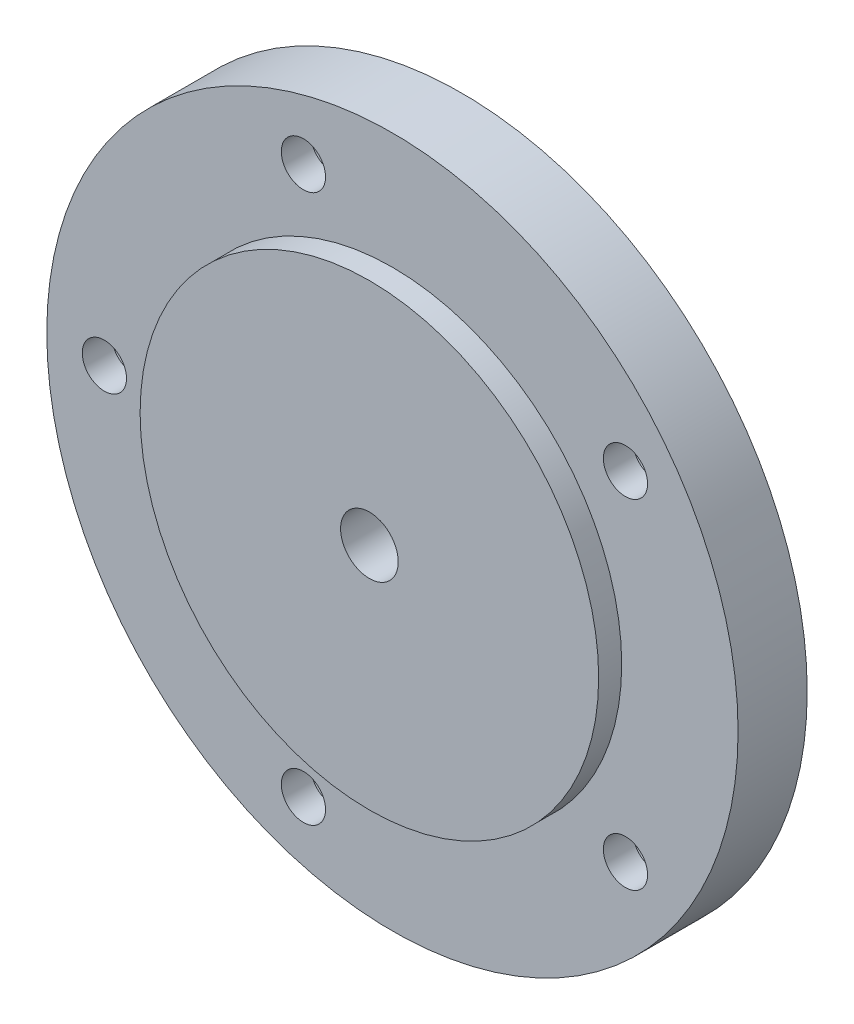
ISO-10303-21;
HEADER;
FILE_DESCRIPTION(('STEP AP214'),'2;1');
FILE_NAME('part.step','',(''),(''),'','','');
FILE_SCHEMA(('AUTOMOTIVE_DESIGN { 1 0 10303 214 1 1 1 1 }'));
ENDSEC;
DATA;
#1=APPLICATION_CONTEXT('core data for automotive mechanical design processes');
#2=APPLICATION_PROTOCOL_DEFINITION('international standard','automotive_design',2000,#1);
#3=PRODUCT_CONTEXT('',#1,'mechanical');
#4=PRODUCT('Part','Part','',(#3));
#5=PRODUCT_RELATED_PRODUCT_CATEGORY('part','',(#4));
#6=PRODUCT_DEFINITION_FORMATION('','',#4);
#7=PRODUCT_DEFINITION_CONTEXT('part definition',#1,'design');
#8=PRODUCT_DEFINITION('design','',#6,#7);
#9=PRODUCT_DEFINITION_SHAPE('','',#8);
#10=(LENGTH_UNIT() NAMED_UNIT(*) SI_UNIT(.MILLI.,.METRE.));
#11=(NAMED_UNIT(*) PLANE_ANGLE_UNIT() SI_UNIT($,.RADIAN.));
#12=(NAMED_UNIT(*) SI_UNIT($,.STERADIAN.) SOLID_ANGLE_UNIT());
#13=UNCERTAINTY_MEASURE_WITH_UNIT(LENGTH_MEASURE(1.E-05),#10,'distance_accuracy_value','');
#14=(GEOMETRIC_REPRESENTATION_CONTEXT(3) GLOBAL_UNCERTAINTY_ASSIGNED_CONTEXT((#13)) GLOBAL_UNIT_ASSIGNED_CONTEXT((#10,
#11,#12)) REPRESENTATION_CONTEXT('',''));
#15=CARTESIAN_POINT('',(0.,0.,0.));
#16=DIRECTION('',(0.,0.,1.));
#17=DIRECTION('',(1.,0.,0.));
#18=AXIS2_PLACEMENT_3D('',#15,#16,#17);
#19=CARTESIAN_POINT('',(0.,0.,3.81));
#20=DIRECTION('',(0.,0.,-1.));
#21=DIRECTION('',(-1.,0.,0.));
#22=AXIS2_PLACEMENT_3D('',#19,#20,#21);
#23=CYLINDRICAL_SURFACE('',#22,19.05);
#24=CARTESIAN_POINT('',(0.,0.,3.81));
#25=DIRECTION('',(0.,0.,1.));
#26=DIRECTION('',(1.,0.,0.));
#27=AXIS2_PLACEMENT_3D('',#24,#25,#26);
#28=CIRCLE('',#27,19.05);
#29=CARTESIAN_POINT('',(19.05,0.,3.81));
#30=VERTEX_POINT('',#29);
#31=EDGE_CURVE('E10',#30,#30,#28,.T.);
#32=ORIENTED_EDGE('',*,*,#31,.F.);
#33=EDGE_LOOP('',(#32));
#34=FACE_BOUND('',#33,.T.);
#35=CARTESIAN_POINT('',(0.,0.,0.));
#36=DIRECTION('',(0.,0.,1.));
#37=DIRECTION('',(1.,0.,0.));
#38=AXIS2_PLACEMENT_3D('',#35,#36,#37);
#39=CIRCLE('',#38,19.05);
#40=CARTESIAN_POINT('',(19.05,0.,0.));
#41=VERTEX_POINT('',#40);
#42=EDGE_CURVE('E38',#41,#41,#39,.T.);
#43=ORIENTED_EDGE('',*,*,#42,.T.);
#44=EDGE_LOOP('',(#43));
#45=FACE_BOUND('',#44,.T.);
#46=ADVANCED_FACE('F31',(#34,#45),#23,.T.);
#47=CARTESIAN_POINT('',(0.,0.,3.81));
#48=DIRECTION('',(0.,0.,1.));
#49=DIRECTION('',(1.,0.,0.));
#50=AXIS2_PLACEMENT_3D('',#47,#48,#49);
#51=PLANE('',#50);
#52=CARTESIAN_POINT('',(-4.90564478570246,-15.0980221961855,3.81));
#53=DIRECTION('',(0.,0.,1.));
#54=DIRECTION('',(1.,0.,0.));
#55=AXIS2_PLACEMENT_3D('',#52,#53,#54);
#56=CIRCLE('',#55,1.2192);
#57=CARTESIAN_POINT('',(-3.68644478570246,-15.0980221961855,3.81));
#58=VERTEX_POINT('',#57);
#59=EDGE_CURVE('E34',#58,#58,#56,.T.);
#60=ORIENTED_EDGE('',*,*,#59,.F.);
#61=EDGE_LOOP('',(#60));
#62=FACE_BOUND('',#61,.T.);
#63=CARTESIAN_POINT('',(12.8431447857022,-9.33109088014312,3.81));
#64=DIRECTION('',(0.,0.,1.));
#65=DIRECTION('',(1.,0.,0.));
#66=AXIS2_PLACEMENT_3D('',#63,#64,#65);
#67=CIRCLE('',#66,1.2192);
#68=CARTESIAN_POINT('',(14.0623447857022,-9.33109088014312,3.81));
#69=VERTEX_POINT('',#68);
#70=EDGE_CURVE('E62',#69,#69,#67,.T.);
#71=ORIENTED_EDGE('',*,*,#70,.F.);
#72=EDGE_LOOP('',(#71));
#73=FACE_BOUND('',#72,.T.);
#74=CARTESIAN_POINT('',(12.8431447857023,9.33109088014294,3.81));
#75=DIRECTION('',(0.,0.,1.));
#76=DIRECTION('',(1.,0.,0.));
#77=AXIS2_PLACEMENT_3D('',#74,#75,#76);
#78=CIRCLE('',#77,1.2192);
#79=CARTESIAN_POINT('',(14.0623447857023,9.33109088014294,3.81));
#80=VERTEX_POINT('',#79);
#81=EDGE_CURVE('E58',#80,#80,#78,.T.);
#82=ORIENTED_EDGE('',*,*,#81,.F.);
#83=EDGE_LOOP('',(#82));
#84=FACE_BOUND('',#83,.T.);
#85=CARTESIAN_POINT('',(-4.90564478570225,15.0980221961856,3.81));
#86=DIRECTION('',(0.,0.,1.));
#87=DIRECTION('',(1.,0.,0.));
#88=AXIS2_PLACEMENT_3D('',#85,#86,#87);
#89=CIRCLE('',#88,1.2192);
#90=CARTESIAN_POINT('',(-3.68644478570225,15.0980221961856,3.81));
#91=VERTEX_POINT('',#90);
#92=EDGE_CURVE('E53',#91,#91,#89,.T.);
#93=ORIENTED_EDGE('',*,*,#92,.F.);
#94=EDGE_LOOP('',(#93));
#95=FACE_BOUND('',#94,.T.);
#96=CARTESIAN_POINT('',(-15.875,0.,3.81));
#97=DIRECTION('',(0.,0.,1.));
#98=DIRECTION('',(1.,0.,0.));
#99=AXIS2_PLACEMENT_3D('',#96,#97,#98);
#100=CIRCLE('',#99,1.2192);
#101=CARTESIAN_POINT('',(-14.6558,0.,3.81));
#102=VERTEX_POINT('',#101);
#103=EDGE_CURVE('E49',#102,#102,#100,.T.);
#104=ORIENTED_EDGE('',*,*,#103,.F.);
#105=EDGE_LOOP('',(#104));
#106=FACE_BOUND('',#105,.T.);
#107=CARTESIAN_POINT('',(0.,0.,3.81));
#108=DIRECTION('',(0.,0.,1.));
#109=DIRECTION('',(1.,0.,0.));
#110=AXIS2_PLACEMENT_3D('',#107,#108,#109);
#111=CIRCLE('',#110,12.6365);
#112=CARTESIAN_POINT('',(12.6365,0.,3.81));
#113=VERTEX_POINT('',#112);
#114=EDGE_CURVE('E46',#113,#113,#111,.T.);
#115=ORIENTED_EDGE('',*,*,#114,.F.);
#116=EDGE_LOOP('',(#115));
#117=FACE_BOUND('',#116,.T.);
#118=ORIENTED_EDGE('',*,*,#31,.T.);
#119=EDGE_LOOP('',(#118));
#120=FACE_BOUND('',#119,.T.);
#121=ADVANCED_FACE('F106',(#62,#73,#84,#95,#106,#117,#120),#51,.T.);
#122=CARTESIAN_POINT('',(0.,0.,0.));
#123=DIRECTION('',(0.,0.,1.));
#124=DIRECTION('',(1.,0.,0.));
#125=AXIS2_PLACEMENT_3D('',#122,#123,#124);
#126=PLANE('',#125);
#127=CARTESIAN_POINT('',(0.,0.,0.));
#128=DIRECTION('',(0.,0.,-1.));
#129=DIRECTION('',(-1.,0.,0.));
#130=AXIS2_PLACEMENT_3D('',#127,#128,#129);
#131=CIRCLE('',#130,1.58749999999999);
#132=CARTESIAN_POINT('',(-1.58749999999999,0.,0.));
#133=VERTEX_POINT('',#132);
#134=EDGE_CURVE('E197',#133,#133,#131,.T.);
#135=ORIENTED_EDGE('',*,*,#134,.F.);
#136=EDGE_LOOP('',(#135));
#137=FACE_BOUND('',#136,.T.);
#138=CARTESIAN_POINT('',(-4.90564478570246,-15.0980221961855,0.));
#139=DIRECTION('',(0.,0.,-1.));
#140=DIRECTION('',(-1.,0.,0.));
#141=AXIS2_PLACEMENT_3D('',#138,#139,#140);
#142=CIRCLE('',#141,2.38124999999999);
#143=CARTESIAN_POINT('',(-7.28689478570246,-15.0980221961855,0.));
#144=VERTEX_POINT('',#143);
#145=EDGE_CURVE('E199',#144,#144,#142,.T.);
#146=ORIENTED_EDGE('',*,*,#145,.F.);
#147=EDGE_LOOP('',(#146));
#148=FACE_BOUND('',#147,.T.);
#149=CARTESIAN_POINT('',(12.8431447857022,-9.33109088014312,0.));
#150=DIRECTION('',(0.,0.,-1.));
#151=DIRECTION('',(-1.,0.,0.));
#152=AXIS2_PLACEMENT_3D('',#149,#150,#151);
#153=CIRCLE('',#152,2.38124999999999);
#154=CARTESIAN_POINT('',(10.4618947857022,-9.33109088014312,0.));
#155=VERTEX_POINT('',#154);
#156=EDGE_CURVE('E77',#155,#155,#153,.T.);
#157=ORIENTED_EDGE('',*,*,#156,.F.);
#158=EDGE_LOOP('',(#157));
#159=FACE_BOUND('',#158,.T.);
#160=CARTESIAN_POINT('',(12.8431447857023,9.33109088014294,0.));
#161=DIRECTION('',(0.,0.,-1.));
#162=DIRECTION('',(-1.,0.,0.));
#163=AXIS2_PLACEMENT_3D('',#160,#161,#162);
#164=CIRCLE('',#163,2.38124999999999);
#165=CARTESIAN_POINT('',(10.4618947857024,9.33109088014294,0.));
#166=VERTEX_POINT('',#165);
#167=EDGE_CURVE('E64',#166,#166,#164,.T.);
#168=ORIENTED_EDGE('',*,*,#167,.F.);
#169=EDGE_LOOP('',(#168));
#170=FACE_BOUND('',#169,.T.);
#171=CARTESIAN_POINT('',(-4.90564478570225,15.0980221961856,0.));
#172=DIRECTION('',(0.,0.,-1.));
#173=DIRECTION('',(-1.,0.,0.));
#174=AXIS2_PLACEMENT_3D('',#171,#172,#173);
#175=CIRCLE('',#174,2.38124999999999);
#176=CARTESIAN_POINT('',(-7.28689478570224,15.0980221961856,0.));
#177=VERTEX_POINT('',#176);
#178=EDGE_CURVE('E60',#177,#177,#175,.T.);
#179=ORIENTED_EDGE('',*,*,#178,.F.);
#180=EDGE_LOOP('',(#179));
#181=FACE_BOUND('',#180,.T.);
#182=CARTESIAN_POINT('',(-15.875,0.,0.));
#183=DIRECTION('',(0.,0.,-1.));
#184=DIRECTION('',(-1.,0.,0.));
#185=AXIS2_PLACEMENT_3D('',#182,#183,#184);
#186=CIRCLE('',#185,2.38124999999999);
#187=CARTESIAN_POINT('',(-18.25625,0.,0.));
#188=VERTEX_POINT('',#187);
#189=EDGE_CURVE('E56',#188,#188,#186,.T.);
#190=ORIENTED_EDGE('',*,*,#189,.F.);
#191=EDGE_LOOP('',(#190));
#192=FACE_BOUND('',#191,.T.);
#193=ORIENTED_EDGE('',*,*,#42,.F.);
#194=EDGE_LOOP('',(#193));
#195=FACE_BOUND('',#194,.T.);
#196=ADVANCED_FACE('F108',(#137,#148,#159,#170,#181,#192,#195),#126,.F.);
#197=CARTESIAN_POINT('',(0.,0.,5.08));
#198=DIRECTION('',(0.,0.,-1.));
#199=DIRECTION('',(-1.,0.,0.));
#200=AXIS2_PLACEMENT_3D('',#197,#198,#199);
#201=CYLINDRICAL_SURFACE('',#200,12.6365);
#202=CARTESIAN_POINT('',(0.,0.,5.08));
#203=DIRECTION('',(0.,0.,1.));
#204=DIRECTION('',(1.,0.,0.));
#205=AXIS2_PLACEMENT_3D('',#202,#203,#204);
#206=CIRCLE('',#205,12.6365);
#207=CARTESIAN_POINT('',(12.6365,0.,5.08));
#208=VERTEX_POINT('',#207);
#209=EDGE_CURVE('E43',#208,#208,#206,.T.);
#210=ORIENTED_EDGE('',*,*,#209,.F.);
#211=EDGE_LOOP('',(#210));
#212=FACE_BOUND('',#211,.T.);
#213=ORIENTED_EDGE('',*,*,#114,.T.);
#214=EDGE_LOOP('',(#213));
#215=FACE_BOUND('',#214,.T.);
#216=ADVANCED_FACE('F104',(#212,#215),#201,.T.);
#217=CARTESIAN_POINT('',(0.,0.,5.08));
#218=DIRECTION('',(0.,0.,1.));
#219=DIRECTION('',(1.,0.,0.));
#220=AXIS2_PLACEMENT_3D('',#217,#218,#219);
#221=PLANE('',#220);
#222=CARTESIAN_POINT('',(0.,0.,5.08));
#223=DIRECTION('',(0.,0.,-1.));
#224=DIRECTION('',(-1.,0.,0.));
#225=AXIS2_PLACEMENT_3D('',#222,#223,#224);
#226=CIRCLE('',#225,1.5875);
#227=CARTESIAN_POINT('',(-1.5875,0.,5.08));
#228=VERTEX_POINT('',#227);
#229=EDGE_CURVE('E194',#228,#228,#226,.T.);
#230=ORIENTED_EDGE('',*,*,#229,.T.);
#231=EDGE_LOOP('',(#230));
#232=FACE_BOUND('',#231,.T.);
#233=ORIENTED_EDGE('',*,*,#209,.T.);
#234=EDGE_LOOP('',(#233));
#235=FACE_BOUND('',#234,.T.);
#236=ADVANCED_FACE('F122',(#232,#235),#221,.T.);
#237=CARTESIAN_POINT('',(-15.875,0.,0.));
#238=DIRECTION('',(0.,0.,-1.));
#239=DIRECTION('',(-1.,0.,0.));
#240=AXIS2_PLACEMENT_3D('',#237,#238,#239);
#241=CYLINDRICAL_SURFACE('',#240,1.2192);
#242=ORIENTED_EDGE('',*,*,#103,.T.);
#243=EDGE_LOOP('',(#242));
#244=FACE_BOUND('',#243,.T.);
#245=CARTESIAN_POINT('',(-15.875,0.,2.1844));
#246=DIRECTION('',(0.,0.,-1.));
#247=DIRECTION('',(-1.,0.,0.));
#248=AXIS2_PLACEMENT_3D('',#245,#246,#247);
#249=CIRCLE('',#248,1.2192);
#250=CARTESIAN_POINT('',(-17.0942,0.,2.1844));
#251=VERTEX_POINT('',#250);
#252=EDGE_CURVE('E52',#251,#251,#249,.T.);
#253=ORIENTED_EDGE('',*,*,#252,.T.);
#254=EDGE_LOOP('',(#253));
#255=FACE_BOUND('',#254,.T.);
#256=ADVANCED_FACE('F126',(#244,#255),#241,.F.);
#257=CARTESIAN_POINT('',(-14.6558,0.,2.1844));
#258=DIRECTION('',(0.,0.,1.));
#259=DIRECTION('',(1.,0.,0.));
#260=AXIS2_PLACEMENT_3D('',#257,#258,#259);
#261=PLANE('',#260);
#262=ORIENTED_EDGE('',*,*,#252,.F.);
#263=EDGE_LOOP('',(#262));
#264=FACE_BOUND('',#263,.T.);
#265=CARTESIAN_POINT('',(-15.875,0.,2.1844));
#266=DIRECTION('',(0.,0.,-1.));
#267=DIRECTION('',(-1.,0.,0.));
#268=AXIS2_PLACEMENT_3D('',#265,#266,#267);
#269=CIRCLE('',#268,2.38124999999999);
#270=CARTESIAN_POINT('',(-18.25625,0.,2.1844));
#271=VERTEX_POINT('',#270);
#272=EDGE_CURVE('E94',#271,#271,#269,.T.);
#273=ORIENTED_EDGE('',*,*,#272,.T.);
#274=EDGE_LOOP('',(#273));
#275=FACE_BOUND('',#274,.T.);
#276=ADVANCED_FACE('F130',(#264,#275),#261,.F.);
#277=CARTESIAN_POINT('',(-15.875,0.,0.));
#278=DIRECTION('',(0.,0.,-1.));
#279=DIRECTION('',(-1.,0.,0.));
#280=AXIS2_PLACEMENT_3D('',#277,#278,#279);
#281=CYLINDRICAL_SURFACE('',#280,2.38124999999999);
#282=ORIENTED_EDGE('',*,*,#272,.F.);
#283=EDGE_LOOP('',(#282));
#284=FACE_BOUND('',#283,.T.);
#285=ORIENTED_EDGE('',*,*,#189,.T.);
#286=EDGE_LOOP('',(#285));
#287=FACE_BOUND('',#286,.T.);
#288=ADVANCED_FACE('F134',(#284,#287),#281,.F.);
#289=CARTESIAN_POINT('',(-4.90564478570225,15.0980221961856,0.));
#290=DIRECTION('',(0.,0.,-1.));
#291=DIRECTION('',(-1.,0.,0.));
#292=AXIS2_PLACEMENT_3D('',#289,#290,#291);
#293=CYLINDRICAL_SURFACE('',#292,1.2192);
#294=ORIENTED_EDGE('',*,*,#92,.T.);
#295=EDGE_LOOP('',(#294));
#296=FACE_BOUND('',#295,.T.);
#297=CARTESIAN_POINT('',(-4.90564478570225,15.0980221961856,2.1844));
#298=DIRECTION('',(0.,0.,-1.));
#299=DIRECTION('',(-1.,0.,0.));
#300=AXIS2_PLACEMENT_3D('',#297,#298,#299);
#301=CIRCLE('',#300,1.2192);
#302=CARTESIAN_POINT('',(-6.12484478570225,15.0980221961856,2.1844));
#303=VERTEX_POINT('',#302);
#304=EDGE_CURVE('E57',#303,#303,#301,.T.);
#305=ORIENTED_EDGE('',*,*,#304,.T.);
#306=EDGE_LOOP('',(#305));
#307=FACE_BOUND('',#306,.T.);
#308=ADVANCED_FACE('F138',(#296,#307),#293,.F.);
#309=CARTESIAN_POINT('',(-3.68644478570225,15.0980221961856,2.1844));
#310=DIRECTION('',(0.,0.,1.));
#311=DIRECTION('',(1.,0.,0.));
#312=AXIS2_PLACEMENT_3D('',#309,#310,#311);
#313=PLANE('',#312);
#314=ORIENTED_EDGE('',*,*,#304,.F.);
#315=EDGE_LOOP('',(#314));
#316=FACE_BOUND('',#315,.T.);
#317=CARTESIAN_POINT('',(-4.90564478570225,15.0980221961856,2.1844));
#318=DIRECTION('',(0.,0.,-1.));
#319=DIRECTION('',(-1.,0.,0.));
#320=AXIS2_PLACEMENT_3D('',#317,#318,#319);
#321=CIRCLE('',#320,2.38125);
#322=CARTESIAN_POINT('',(-7.28689478570224,15.0980221961856,2.1844));
#323=VERTEX_POINT('',#322);
#324=EDGE_CURVE('E87',#323,#323,#321,.T.);
#325=ORIENTED_EDGE('',*,*,#324,.T.);
#326=EDGE_LOOP('',(#325));
#327=FACE_BOUND('',#326,.T.);
#328=ADVANCED_FACE('F142',(#316,#327),#313,.F.);
#329=CARTESIAN_POINT('',(-4.90564478570225,15.0980221961856,0.));
#330=DIRECTION('',(0.,0.,-1.));
#331=DIRECTION('',(-1.,0.,0.));
#332=AXIS2_PLACEMENT_3D('',#329,#330,#331);
#333=CYLINDRICAL_SURFACE('',#332,2.38124999999999);
#334=ORIENTED_EDGE('',*,*,#324,.F.);
#335=EDGE_LOOP('',(#334));
#336=FACE_BOUND('',#335,.T.);
#337=ORIENTED_EDGE('',*,*,#178,.T.);
#338=EDGE_LOOP('',(#337));
#339=FACE_BOUND('',#338,.T.);
#340=ADVANCED_FACE('F146',(#336,#339),#333,.F.);
#341=CARTESIAN_POINT('',(12.8431447857023,9.33109088014294,0.));
#342=DIRECTION('',(0.,0.,-1.));
#343=DIRECTION('',(-1.,0.,0.));
#344=AXIS2_PLACEMENT_3D('',#341,#342,#343);
#345=CYLINDRICAL_SURFACE('',#344,1.2192);
#346=ORIENTED_EDGE('',*,*,#81,.T.);
#347=EDGE_LOOP('',(#346));
#348=FACE_BOUND('',#347,.T.);
#349=CARTESIAN_POINT('',(12.8431447857023,9.33109088014294,2.1844));
#350=DIRECTION('',(0.,0.,-1.));
#351=DIRECTION('',(-1.,0.,0.));
#352=AXIS2_PLACEMENT_3D('',#349,#350,#351);
#353=CIRCLE('',#352,1.2192);
#354=CARTESIAN_POINT('',(11.6239447857023,9.33109088014294,2.1844));
#355=VERTEX_POINT('',#354);
#356=EDGE_CURVE('E61',#355,#355,#353,.T.);
#357=ORIENTED_EDGE('',*,*,#356,.T.);
#358=EDGE_LOOP('',(#357));
#359=FACE_BOUND('',#358,.T.);
#360=ADVANCED_FACE('F150',(#348,#359),#345,.F.);
#361=CARTESIAN_POINT('',(14.0623447857023,9.33109088014294,2.1844));
#362=DIRECTION('',(0.,0.,1.));
#363=DIRECTION('',(1.,0.,0.));
#364=AXIS2_PLACEMENT_3D('',#361,#362,#363);
#365=PLANE('',#364);
#366=ORIENTED_EDGE('',*,*,#356,.F.);
#367=EDGE_LOOP('',(#366));
#368=FACE_BOUND('',#367,.T.);
#369=CARTESIAN_POINT('',(12.8431447857023,9.33109088014294,2.1844));
#370=DIRECTION('',(0.,0.,-1.));
#371=DIRECTION('',(-1.,0.,0.));
#372=AXIS2_PLACEMENT_3D('',#369,#370,#371);
#373=CIRCLE('',#372,2.38124999999999);
#374=CARTESIAN_POINT('',(10.4618947857024,9.33109088014294,2.1844));
#375=VERTEX_POINT('',#374);
#376=EDGE_CURVE('E69',#375,#375,#373,.T.);
#377=ORIENTED_EDGE('',*,*,#376,.T.);
#378=EDGE_LOOP('',(#377));
#379=FACE_BOUND('',#378,.T.);
#380=ADVANCED_FACE('F154',(#368,#379),#365,.F.);
#381=CARTESIAN_POINT('',(12.8431447857023,9.33109088014294,0.));
#382=DIRECTION('',(0.,0.,-1.));
#383=DIRECTION('',(-1.,0.,0.));
#384=AXIS2_PLACEMENT_3D('',#381,#382,#383);
#385=CYLINDRICAL_SURFACE('',#384,2.38124999999999);
#386=ORIENTED_EDGE('',*,*,#376,.F.);
#387=EDGE_LOOP('',(#386));
#388=FACE_BOUND('',#387,.T.);
#389=ORIENTED_EDGE('',*,*,#167,.T.);
#390=EDGE_LOOP('',(#389));
#391=FACE_BOUND('',#390,.T.);
#392=ADVANCED_FACE('F158',(#388,#391),#385,.F.);
#393=CARTESIAN_POINT('',(12.8431447857022,-9.33109088014312,0.));
#394=DIRECTION('',(0.,0.,-1.));
#395=DIRECTION('',(-1.,0.,0.));
#396=AXIS2_PLACEMENT_3D('',#393,#394,#395);
#397=CYLINDRICAL_SURFACE('',#396,1.2192);
#398=ORIENTED_EDGE('',*,*,#70,.T.);
#399=EDGE_LOOP('',(#398));
#400=FACE_BOUND('',#399,.T.);
#401=CARTESIAN_POINT('',(12.8431447857022,-9.33109088014312,2.1844));
#402=DIRECTION('',(0.,0.,-1.));
#403=DIRECTION('',(-1.,0.,0.));
#404=AXIS2_PLACEMENT_3D('',#401,#402,#403);
#405=CIRCLE('',#404,1.2192);
#406=CARTESIAN_POINT('',(11.6239447857022,-9.33109088014312,2.1844));
#407=VERTEX_POINT('',#406);
#408=EDGE_CURVE('E65',#407,#407,#405,.T.);
#409=ORIENTED_EDGE('',*,*,#408,.T.);
#410=EDGE_LOOP('',(#409));
#411=FACE_BOUND('',#410,.T.);
#412=ADVANCED_FACE('F162',(#400,#411),#397,.F.);
#413=CARTESIAN_POINT('',(14.0623447857022,-9.33109088014312,2.1844));
#414=DIRECTION('',(0.,0.,1.));
#415=DIRECTION('',(1.,0.,0.));
#416=AXIS2_PLACEMENT_3D('',#413,#414,#415);
#417=PLANE('',#416);
#418=ORIENTED_EDGE('',*,*,#408,.F.);
#419=EDGE_LOOP('',(#418));
#420=FACE_BOUND('',#419,.T.);
#421=CARTESIAN_POINT('',(12.8431447857022,-9.33109088014312,2.1844));
#422=DIRECTION('',(0.,0.,-1.));
#423=DIRECTION('',(-1.,0.,0.));
#424=AXIS2_PLACEMENT_3D('',#421,#422,#423);
#425=CIRCLE('',#424,2.38124999999999);
#426=CARTESIAN_POINT('',(10.4618947857022,-9.33109088014312,2.1844));
#427=VERTEX_POINT('',#426);
#428=EDGE_CURVE('E72',#427,#427,#425,.T.);
#429=ORIENTED_EDGE('',*,*,#428,.T.);
#430=EDGE_LOOP('',(#429));
#431=FACE_BOUND('',#430,.T.);
#432=ADVANCED_FACE('F166',(#420,#431),#417,.F.);
#433=CARTESIAN_POINT('',(12.8431447857022,-9.33109088014312,0.));
#434=DIRECTION('',(0.,0.,-1.));
#435=DIRECTION('',(-1.,0.,0.));
#436=AXIS2_PLACEMENT_3D('',#433,#434,#435);
#437=CYLINDRICAL_SURFACE('',#436,2.38124999999999);
#438=ORIENTED_EDGE('',*,*,#428,.F.);
#439=EDGE_LOOP('',(#438));
#440=FACE_BOUND('',#439,.T.);
#441=ORIENTED_EDGE('',*,*,#156,.T.);
#442=EDGE_LOOP('',(#441));
#443=FACE_BOUND('',#442,.T.);
#444=ADVANCED_FACE('F169',(#440,#443),#437,.F.);
#445=CARTESIAN_POINT('',(-4.90564478570246,-15.0980221961855,0.));
#446=DIRECTION('',(0.,0.,-1.));
#447=DIRECTION('',(-1.,0.,0.));
#448=AXIS2_PLACEMENT_3D('',#445,#446,#447);
#449=CYLINDRICAL_SURFACE('',#448,1.2192);
#450=ORIENTED_EDGE('',*,*,#59,.T.);
#451=EDGE_LOOP('',(#450));
#452=FACE_BOUND('',#451,.T.);
#453=CARTESIAN_POINT('',(-4.90564478570246,-15.0980221961855,2.1844));
#454=DIRECTION('',(0.,0.,-1.));
#455=DIRECTION('',(-1.,0.,0.));
#456=AXIS2_PLACEMENT_3D('',#453,#454,#455);
#457=CIRCLE('',#456,1.2192);
#458=CARTESIAN_POINT('',(-6.12484478570246,-15.0980221961855,2.1844));
#459=VERTEX_POINT('',#458);
#460=EDGE_CURVE('E207',#459,#459,#457,.T.);
#461=ORIENTED_EDGE('',*,*,#460,.T.);
#462=EDGE_LOOP('',(#461));
#463=FACE_BOUND('',#462,.T.);
#464=ADVANCED_FACE('F173',(#452,#463),#449,.F.);
#465=CARTESIAN_POINT('',(-3.68644478570246,-15.0980221961855,2.1844));
#466=DIRECTION('',(0.,0.,1.));
#467=DIRECTION('',(1.,0.,0.));
#468=AXIS2_PLACEMENT_3D('',#465,#466,#467);
#469=PLANE('',#468);
#470=ORIENTED_EDGE('',*,*,#460,.F.);
#471=EDGE_LOOP('',(#470));
#472=FACE_BOUND('',#471,.T.);
#473=CARTESIAN_POINT('',(-4.90564478570246,-15.0980221961855,2.1844));
#474=DIRECTION('',(0.,0.,-1.));
#475=DIRECTION('',(-1.,0.,0.));
#476=AXIS2_PLACEMENT_3D('',#473,#474,#475);
#477=CIRCLE('',#476,2.38125);
#478=CARTESIAN_POINT('',(-7.28689478570246,-15.0980221961855,2.1844));
#479=VERTEX_POINT('',#478);
#480=EDGE_CURVE('E204',#479,#479,#477,.T.);
#481=ORIENTED_EDGE('',*,*,#480,.T.);
#482=EDGE_LOOP('',(#481));
#483=FACE_BOUND('',#482,.T.);
#484=ADVANCED_FACE('F177',(#472,#483),#469,.F.);
#485=CARTESIAN_POINT('',(-4.90564478570246,-15.0980221961855,0.));
#486=DIRECTION('',(0.,0.,-1.));
#487=DIRECTION('',(-1.,0.,0.));
#488=AXIS2_PLACEMENT_3D('',#485,#486,#487);
#489=CYLINDRICAL_SURFACE('',#488,2.38124999999999);
#490=ORIENTED_EDGE('',*,*,#480,.F.);
#491=EDGE_LOOP('',(#490));
#492=FACE_BOUND('',#491,.T.);
#493=ORIENTED_EDGE('',*,*,#145,.T.);
#494=EDGE_LOOP('',(#493));
#495=FACE_BOUND('',#494,.T.);
#496=ADVANCED_FACE('F181',(#492,#495),#489,.F.);
#497=CARTESIAN_POINT('',(0.,0.,0.));
#498=DIRECTION('',(0.,0.,-1.));
#499=DIRECTION('',(-1.,0.,0.));
#500=AXIS2_PLACEMENT_3D('',#497,#498,#499);
#501=CYLINDRICAL_SURFACE('',#500,1.58749999999999);
#502=ORIENTED_EDGE('',*,*,#229,.F.);
#503=EDGE_LOOP('',(#502));
#504=FACE_BOUND('',#503,.T.);
#505=ORIENTED_EDGE('',*,*,#134,.T.);
#506=EDGE_LOOP('',(#505));
#507=FACE_BOUND('',#506,.T.);
#508=ADVANCED_FACE('F185',(#504,#507),#501,.F.);
#509=CLOSED_SHELL('',(#46,#121,#196,#216,#236,#256,#276,#288,#308,#328,#340,#360,#380,#392,#412,
#432,#444,#464,#484,#496,#508));
#510=MANIFOLD_SOLID_BREP('B2',#509);
#511=ADVANCED_BREP_SHAPE_REPRESENTATION('',(#18,#510),#14);
#512=SHAPE_DEFINITION_REPRESENTATION(#9,#511);
ENDSEC;
END-ISO-10303-21;
